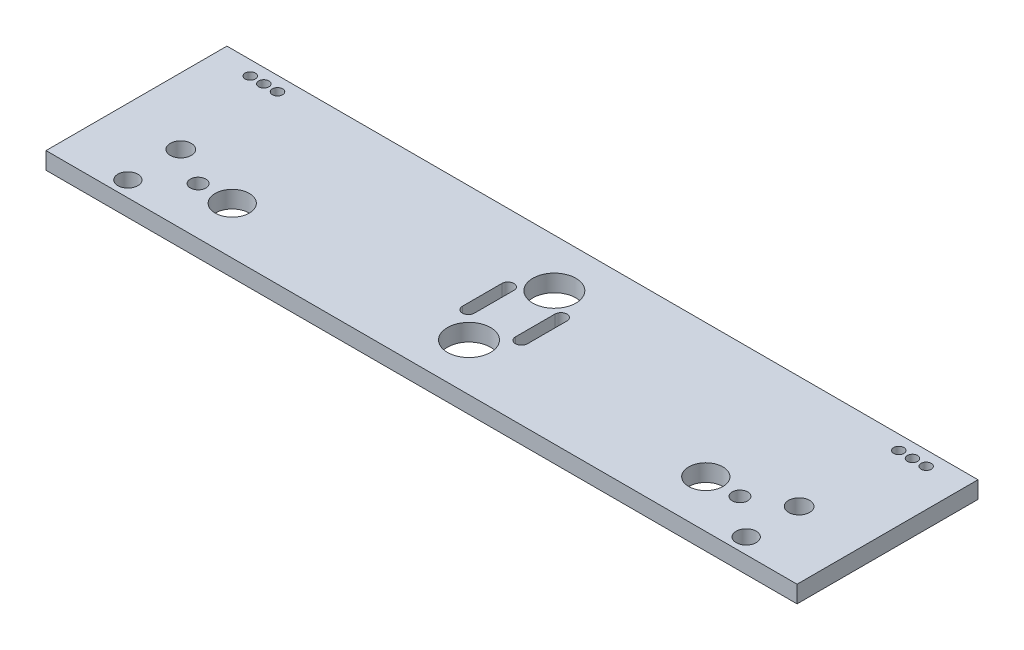
ISO-10303-21;
HEADER;
FILE_DESCRIPTION(('STEP AP214'),'2;1');
FILE_NAME('part.step','',(''),(''),'','','');
FILE_SCHEMA(('AUTOMOTIVE_DESIGN { 1 0 10303 214 1 1 1 1 }'));
ENDSEC;
DATA;
#1=APPLICATION_CONTEXT('core data for automotive mechanical design processes');
#2=APPLICATION_PROTOCOL_DEFINITION('international standard','automotive_design',2000,#1);
#3=PRODUCT_CONTEXT('',#1,'mechanical');
#4=PRODUCT('Part','Part','',(#3));
#5=PRODUCT_RELATED_PRODUCT_CATEGORY('part','',(#4));
#6=PRODUCT_DEFINITION_FORMATION('','',#4);
#7=PRODUCT_DEFINITION_CONTEXT('part definition',#1,'design');
#8=PRODUCT_DEFINITION('design','',#6,#7);
#9=PRODUCT_DEFINITION_SHAPE('','',#8);
#10=(LENGTH_UNIT() NAMED_UNIT(*) SI_UNIT(.MILLI.,.METRE.));
#11=(NAMED_UNIT(*) PLANE_ANGLE_UNIT() SI_UNIT($,.RADIAN.));
#12=(NAMED_UNIT(*) SI_UNIT($,.STERADIAN.) SOLID_ANGLE_UNIT());
#13=UNCERTAINTY_MEASURE_WITH_UNIT(LENGTH_MEASURE(1.E-05),#10,'distance_accuracy_value','');
#14=(GEOMETRIC_REPRESENTATION_CONTEXT(3) GLOBAL_UNCERTAINTY_ASSIGNED_CONTEXT((#13)) GLOBAL_UNIT_ASSIGNED_CONTEXT((#10,
#11,#12)) REPRESENTATION_CONTEXT('',''));
#15=CARTESIAN_POINT('',(0.,0.,0.));
#16=DIRECTION('',(0.,0.,1.));
#17=DIRECTION('',(1.,0.,0.));
#18=AXIS2_PLACEMENT_3D('',#15,#16,#17);
#19=CARTESIAN_POINT('',(-48.8743724696357,5.,0.));
#20=DIRECTION('',(1.,0.,0.));
#21=DIRECTION('',(0.,0.,-1.));
#22=AXIS2_PLACEMENT_3D('',#19,#20,#21);
#23=PLANE('',#22);
#24=DIRECTION('',(0.,0.,1.));
#25=VECTOR('',#24,1.);
#26=CARTESIAN_POINT('',(-48.8743724696357,0.,0.));
#27=LINE('',#26,#25);
#28=CARTESIAN_POINT('',(-48.8743724696357,0.,-23.1611978488646));
#29=VERTEX_POINT('',#28);
#30=CARTESIAN_POINT('',(-48.8743724696357,0.,-11.5911978488646));
#31=VERTEX_POINT('',#30);
#32=EDGE_CURVE('E226',#29,#31,#27,.T.);
#33=ORIENTED_EDGE('',*,*,#32,.T.);
#34=DIRECTION('',(0.,-1.,0.));
#35=VECTOR('',#34,1.);
#36=CARTESIAN_POINT('',(-48.8743724696357,5.,-11.5911978488646));
#37=LINE('',#36,#35);
#38=CARTESIAN_POINT('',(-48.8743724696357,5.,-11.5911978488646));
#39=VERTEX_POINT('',#38);
#40=EDGE_CURVE('E11',#39,#31,#37,.T.);
#41=ORIENTED_EDGE('',*,*,#40,.F.);
#42=DIRECTION('',(0.,0.,1.));
#43=VECTOR('',#42,1.);
#44=CARTESIAN_POINT('',(-48.8743724696357,5.,0.));
#45=LINE('',#44,#43);
#46=CARTESIAN_POINT('',(-48.8743724696357,5.,-23.1611978488646));
#47=VERTEX_POINT('',#46);
#48=EDGE_CURVE('E137',#47,#39,#45,.T.);
#49=ORIENTED_EDGE('',*,*,#48,.F.);
#50=DIRECTION('',(0.,-1.,0.));
#51=VECTOR('',#50,1.);
#52=CARTESIAN_POINT('',(-48.8743724696357,5.,-23.1611978488646));
#53=LINE('',#52,#51);
#54=EDGE_CURVE('E240',#47,#29,#53,.T.);
#55=ORIENTED_EDGE('',*,*,#54,.T.);
#56=EDGE_LOOP('',(#33,#41,#49,#55));
#57=FACE_BOUND('',#56,.T.);
#58=ADVANCED_FACE('F35',(#57),#23,.F.);
#59=CARTESIAN_POINT('',(-50.6343724696357,5.,-11.5911978488646));
#60=DIRECTION('',(0.,-1.,0.));
#61=DIRECTION('',(0.,0.,-1.));
#62=AXIS2_PLACEMENT_3D('',#59,#60,#61);
#63=CYLINDRICAL_SURFACE('',#62,1.76);
#64=CARTESIAN_POINT('',(-50.6343724696357,0.,-11.5911978488646));
#65=DIRECTION('',(0.,1.,0.));
#66=DIRECTION('',(0.,0.,1.));
#67=AXIS2_PLACEMENT_3D('',#64,#65,#66);
#68=CIRCLE('',#67,1.76);
#69=CARTESIAN_POINT('',(-52.3943724696356,0.,-11.5911978488646));
#70=VERTEX_POINT('',#69);
#71=EDGE_CURVE('E143',#31,#70,#68,.F.);
#72=ORIENTED_EDGE('',*,*,#71,.T.);
#73=DIRECTION('',(0.,-1.,0.));
#74=VECTOR('',#73,1.);
#75=CARTESIAN_POINT('',(-52.3943724696356,5.,-11.5911978488646));
#76=LINE('',#75,#74);
#77=CARTESIAN_POINT('',(-52.3943724696356,5.,-11.5911978488646));
#78=VERTEX_POINT('',#77);
#79=EDGE_CURVE('E45',#78,#70,#76,.T.);
#80=ORIENTED_EDGE('',*,*,#79,.F.);
#81=CARTESIAN_POINT('',(-50.6343724696357,5.,-11.5911978488646));
#82=DIRECTION('',(0.,1.,0.));
#83=DIRECTION('',(0.,0.,1.));
#84=AXIS2_PLACEMENT_3D('',#81,#82,#83);
#85=CIRCLE('',#84,1.76);
#86=EDGE_CURVE('E130',#39,#78,#85,.F.);
#87=ORIENTED_EDGE('',*,*,#86,.F.);
#88=ORIENTED_EDGE('',*,*,#40,.T.);
#89=EDGE_LOOP('',(#72,#80,#87,#88));
#90=FACE_BOUND('',#89,.T.);
#91=ADVANCED_FACE('F142',(#90),#63,.F.);
#92=CARTESIAN_POINT('',(-52.3943724696356,5.,0.));
#93=DIRECTION('',(1.,0.,0.));
#94=DIRECTION('',(0.,0.,-1.));
#95=AXIS2_PLACEMENT_3D('',#92,#93,#94);
#96=PLANE('',#95);
#97=DIRECTION('',(0.,0.,1.));
#98=VECTOR('',#97,1.);
#99=CARTESIAN_POINT('',(-52.3943724696356,0.,0.));
#100=LINE('',#99,#98);
#101=CARTESIAN_POINT('',(-52.3943724696356,0.,-23.1611978488646));
#102=VERTEX_POINT('',#101);
#103=EDGE_CURVE('E230',#102,#70,#100,.T.);
#104=ORIENTED_EDGE('',*,*,#103,.F.);
#105=DIRECTION('',(0.,-1.,0.));
#106=VECTOR('',#105,1.);
#107=CARTESIAN_POINT('',(-52.3943724696356,5.,-23.1611978488646));
#108=LINE('',#107,#106);
#109=CARTESIAN_POINT('',(-52.3943724696356,5.,-23.1611978488646));
#110=VERTEX_POINT('',#109);
#111=EDGE_CURVE('E94',#110,#102,#108,.T.);
#112=ORIENTED_EDGE('',*,*,#111,.F.);
#113=DIRECTION('',(0.,0.,1.));
#114=VECTOR('',#113,1.);
#115=CARTESIAN_POINT('',(-52.3943724696356,5.,0.));
#116=LINE('',#115,#114);
#117=EDGE_CURVE('E135',#110,#78,#116,.T.);
#118=ORIENTED_EDGE('',*,*,#117,.T.);
#119=ORIENTED_EDGE('',*,*,#79,.T.);
#120=EDGE_LOOP('',(#104,#112,#118,#119));
#121=FACE_BOUND('',#120,.T.);
#122=ADVANCED_FACE('F148',(#121),#96,.T.);
#123=CARTESIAN_POINT('',(67.1356275303644,5.,0.));
#124=DIRECTION('',(1.,0.,0.));
#125=DIRECTION('',(0.,0.,-1.));
#126=AXIS2_PLACEMENT_3D('',#123,#124,#125);
#127=PLANE('',#126);
#128=DIRECTION('',(0.,0.,1.));
#129=VECTOR('',#128,1.);
#130=CARTESIAN_POINT('',(67.1356275303644,0.,0.));
#131=LINE('',#130,#129);
#132=CARTESIAN_POINT('',(67.1356275303644,0.,-43.0870445344129));
#133=VERTEX_POINT('',#132);
#134=CARTESIAN_POINT('',(67.1356275303644,0.,9.91295546558705));
#135=VERTEX_POINT('',#134);
#136=EDGE_CURVE('E214',#133,#135,#131,.T.);
#137=ORIENTED_EDGE('',*,*,#136,.F.);
#138=DIRECTION('',(0.,-1.,0.));
#139=VECTOR('',#138,1.);
#140=CARTESIAN_POINT('',(67.1356275303644,5.,-43.0870445344129));
#141=LINE('',#140,#139);
#142=CARTESIAN_POINT('',(67.1356275303644,5.,-43.0870445344129));
#143=VERTEX_POINT('',#142);
#144=EDGE_CURVE('E242',#143,#133,#141,.T.);
#145=ORIENTED_EDGE('',*,*,#144,.F.);
#146=DIRECTION('',(0.,0.,1.));
#147=VECTOR('',#146,1.);
#148=CARTESIAN_POINT('',(67.1356275303644,5.,0.));
#149=LINE('',#148,#147);
#150=CARTESIAN_POINT('',(67.1356275303644,5.,9.91295546558705));
#151=VERTEX_POINT('',#150);
#152=EDGE_CURVE('E307',#143,#151,#149,.T.);
#153=ORIENTED_EDGE('',*,*,#152,.T.);
#154=DIRECTION('',(0.,-1.,0.));
#155=VECTOR('',#154,1.);
#156=CARTESIAN_POINT('',(67.1356275303644,5.,9.91295546558705));
#157=LINE('',#156,#155);
#158=EDGE_CURVE('E244',#151,#135,#157,.T.);
#159=ORIENTED_EDGE('',*,*,#158,.T.);
#160=EDGE_LOOP('',(#137,#145,#153,#159));
#161=FACE_BOUND('',#160,.T.);
#162=ADVANCED_FACE('F327',(#161),#127,.T.);
#163=CARTESIAN_POINT('',(0.,5.,-43.0870445344129));
#164=DIRECTION('',(0.,0.,-1.));
#165=DIRECTION('',(-1.,0.,0.));
#166=AXIS2_PLACEMENT_3D('',#163,#164,#165);
#167=PLANE('',#166);
#168=DIRECTION('',(1.,0.,0.));
#169=VECTOR('',#168,1.);
#170=CARTESIAN_POINT('',(0.,0.,-43.0870445344129));
#171=LINE('',#170,#169);
#172=CARTESIAN_POINT('',(-152.864372469636,0.,-43.0870445344129));
#173=VERTEX_POINT('',#172);
#174=EDGE_CURVE('E217',#173,#133,#171,.T.);
#175=ORIENTED_EDGE('',*,*,#174,.F.);
#176=DIRECTION('',(0.,-1.,0.));
#177=VECTOR('',#176,1.);
#178=CARTESIAN_POINT('',(-152.864372469636,5.,-43.0870445344129));
#179=LINE('',#178,#177);
#180=CARTESIAN_POINT('',(-152.864372469636,5.,-43.0870445344129));
#181=VERTEX_POINT('',#180);
#182=EDGE_CURVE('E249',#181,#173,#179,.T.);
#183=ORIENTED_EDGE('',*,*,#182,.F.);
#184=DIRECTION('',(1.,0.,0.));
#185=VECTOR('',#184,1.);
#186=CARTESIAN_POINT('',(0.,5.,-43.0870445344129));
#187=LINE('',#186,#185);
#188=EDGE_CURVE('E310',#181,#143,#187,.T.);
#189=ORIENTED_EDGE('',*,*,#188,.T.);
#190=ORIENTED_EDGE('',*,*,#144,.T.);
#191=EDGE_LOOP('',(#175,#183,#189,#190));
#192=FACE_BOUND('',#191,.T.);
#193=ADVANCED_FACE('F330',(#192),#167,.T.);
#194=CARTESIAN_POINT('',(-152.864372469636,5.,0.));
#195=DIRECTION('',(1.,0.,0.));
#196=DIRECTION('',(0.,0.,-1.));
#197=AXIS2_PLACEMENT_3D('',#194,#195,#196);
#198=PLANE('',#197);
#199=DIRECTION('',(0.,0.,1.));
#200=VECTOR('',#199,1.);
#201=CARTESIAN_POINT('',(-152.864372469636,0.,0.));
#202=LINE('',#201,#200);
#203=CARTESIAN_POINT('',(-152.864372469636,0.,9.91295546558705));
#204=VERTEX_POINT('',#203);
#205=EDGE_CURVE('E220',#173,#204,#202,.T.);
#206=ORIENTED_EDGE('',*,*,#205,.T.);
#207=DIRECTION('',(0.,-1.,0.));
#208=VECTOR('',#207,1.);
#209=CARTESIAN_POINT('',(-152.864372469636,5.,9.91295546558705));
#210=LINE('',#209,#208);
#211=CARTESIAN_POINT('',(-152.864372469636,5.,9.91295546558705));
#212=VERTEX_POINT('',#211);
#213=EDGE_CURVE('E246',#212,#204,#210,.T.);
#214=ORIENTED_EDGE('',*,*,#213,.F.);
#215=DIRECTION('',(0.,0.,1.));
#216=VECTOR('',#215,1.);
#217=CARTESIAN_POINT('',(-152.864372469636,5.,0.));
#218=LINE('',#217,#216);
#219=EDGE_CURVE('E313',#181,#212,#218,.T.);
#220=ORIENTED_EDGE('',*,*,#219,.F.);
#221=ORIENTED_EDGE('',*,*,#182,.T.);
#222=EDGE_LOOP('',(#206,#214,#220,#221));
#223=FACE_BOUND('',#222,.T.);
#224=ADVANCED_FACE('F333',(#223),#198,.F.);
#225=CARTESIAN_POINT('',(-35.0943724696356,5.,-23.1611978488646));
#226=DIRECTION('',(0.,-1.,0.));
#227=DIRECTION('',(0.,0.,-1.));
#228=AXIS2_PLACEMENT_3D('',#225,#226,#227);
#229=CYLINDRICAL_SURFACE('',#228,1.76000000000001);
#230=CARTESIAN_POINT('',(-35.0943724696356,0.,-23.1611978488646));
#231=DIRECTION('',(0.,1.,0.));
#232=DIRECTION('',(0.,0.,1.));
#233=AXIS2_PLACEMENT_3D('',#230,#231,#232);
#234=CIRCLE('',#233,1.76000000000001);
#235=CARTESIAN_POINT('',(-33.3343724696356,0.,-23.1611978488646));
#236=VERTEX_POINT('',#235);
#237=CARTESIAN_POINT('',(-36.8543724696356,0.,-23.1611978488646));
#238=VERTEX_POINT('',#237);
#239=EDGE_CURVE('E178',#236,#238,#234,.T.);
#240=ORIENTED_EDGE('',*,*,#239,.F.);
#241=DIRECTION('',(0.,-1.,0.));
#242=VECTOR('',#241,1.);
#243=CARTESIAN_POINT('',(-33.3343724696356,5.,-23.1611978488646));
#244=LINE('',#243,#242);
#245=CARTESIAN_POINT('',(-33.3343724696356,5.,-23.1611978488646));
#246=VERTEX_POINT('',#245);
#247=EDGE_CURVE('E39',#246,#236,#244,.T.);
#248=ORIENTED_EDGE('',*,*,#247,.F.);
#249=CARTESIAN_POINT('',(-35.0943724696356,5.,-23.1611978488646));
#250=DIRECTION('',(0.,1.,0.));
#251=DIRECTION('',(0.,0.,1.));
#252=AXIS2_PLACEMENT_3D('',#249,#250,#251);
#253=CIRCLE('',#252,1.76000000000001);
#254=CARTESIAN_POINT('',(-36.8543724696356,5.,-23.1611978488646));
#255=VERTEX_POINT('',#254);
#256=EDGE_CURVE('E472',#246,#255,#253,.T.);
#257=ORIENTED_EDGE('',*,*,#256,.T.);
#258=DIRECTION('',(0.,-1.,0.));
#259=VECTOR('',#258,1.);
#260=CARTESIAN_POINT('',(-36.8543724696356,5.,-23.1611978488646));
#261=LINE('',#260,#259);
#262=EDGE_CURVE('E159',#255,#238,#261,.T.);
#263=ORIENTED_EDGE('',*,*,#262,.T.);
#264=EDGE_LOOP('',(#240,#248,#257,#263));
#265=FACE_BOUND('',#264,.T.);
#266=ADVANCED_FACE('F264',(#265),#229,.F.);
#267=CARTESIAN_POINT('',(-33.3343724696356,5.,0.));
#268=DIRECTION('',(-1.,0.,0.));
#269=DIRECTION('',(0.,0.,1.));
#270=AXIS2_PLACEMENT_3D('',#267,#268,#269);
#271=PLANE('',#270);
#272=DIRECTION('',(0.,0.,-1.));
#273=VECTOR('',#272,1.);
#274=CARTESIAN_POINT('',(-33.3343724696356,0.,0.));
#275=LINE('',#274,#273);
#276=CARTESIAN_POINT('',(-33.3343724696356,0.,-11.5911978488646));
#277=VERTEX_POINT('',#276);
#278=EDGE_CURVE('E181',#277,#236,#275,.T.);
#279=ORIENTED_EDGE('',*,*,#278,.F.);
#280=DIRECTION('',(0.,-1.,0.));
#281=VECTOR('',#280,1.);
#282=CARTESIAN_POINT('',(-33.3343724696356,5.,-11.5911978488646));
#283=LINE('',#282,#281);
#284=CARTESIAN_POINT('',(-33.3343724696356,5.,-11.5911978488646));
#285=VERTEX_POINT('',#284);
#286=EDGE_CURVE('E254',#285,#277,#283,.T.);
#287=ORIENTED_EDGE('',*,*,#286,.F.);
#288=DIRECTION('',(0.,0.,-1.));
#289=VECTOR('',#288,1.);
#290=CARTESIAN_POINT('',(-33.3343724696356,5.,0.));
#291=LINE('',#290,#289);
#292=EDGE_CURVE('E263',#285,#246,#291,.T.);
#293=ORIENTED_EDGE('',*,*,#292,.T.);
#294=ORIENTED_EDGE('',*,*,#247,.T.);
#295=EDGE_LOOP('',(#279,#287,#293,#294));
#296=FACE_BOUND('',#295,.T.);
#297=ADVANCED_FACE('F261',(#296),#271,.T.);
#298=CARTESIAN_POINT('',(-35.0943724696357,5.,-11.5911978488646));
#299=DIRECTION('',(0.,-1.,0.));
#300=DIRECTION('',(0.,0.,-1.));
#301=AXIS2_PLACEMENT_3D('',#298,#299,#300);
#302=CYLINDRICAL_SURFACE('',#301,1.76000000000001);
#303=CARTESIAN_POINT('',(-35.0943724696357,0.,-11.5911978488646));
#304=DIRECTION('',(0.,1.,0.));
#305=DIRECTION('',(0.,0.,1.));
#306=AXIS2_PLACEMENT_3D('',#303,#304,#305);
#307=CIRCLE('',#306,1.76000000000001);
#308=CARTESIAN_POINT('',(-36.8543724696357,0.,-11.5911978488646));
#309=VERTEX_POINT('',#308);
#310=EDGE_CURVE('E184',#309,#277,#307,.T.);
#311=ORIENTED_EDGE('',*,*,#310,.F.);
#312=DIRECTION('',(0.,-1.,0.));
#313=VECTOR('',#312,1.);
#314=CARTESIAN_POINT('',(-36.8543724696357,5.,-11.5911978488646));
#315=LINE('',#314,#313);
#316=CARTESIAN_POINT('',(-36.8543724696357,5.,-11.5911978488646));
#317=VERTEX_POINT('',#316);
#318=EDGE_CURVE('E253',#317,#309,#315,.T.);
#319=ORIENTED_EDGE('',*,*,#318,.F.);
#320=CARTESIAN_POINT('',(-35.0943724696357,5.,-11.5911978488646));
#321=DIRECTION('',(0.,1.,0.));
#322=DIRECTION('',(0.,0.,1.));
#323=AXIS2_PLACEMENT_3D('',#320,#321,#322);
#324=CIRCLE('',#323,1.76000000000001);
#325=EDGE_CURVE('E271',#317,#285,#324,.T.);
#326=ORIENTED_EDGE('',*,*,#325,.T.);
#327=ORIENTED_EDGE('',*,*,#286,.T.);
#328=EDGE_LOOP('',(#311,#319,#326,#327));
#329=FACE_BOUND('',#328,.T.);
#330=ADVANCED_FACE('F269',(#329),#302,.F.);
#331=CARTESIAN_POINT('',(-133.426055638965,5.,-10.1273106860022));
#332=DIRECTION('',(0.,-1.,0.));
#333=DIRECTION('',(0.,0.,-1.));
#334=AXIS2_PLACEMENT_3D('',#331,#332,#333);
#335=CYLINDRICAL_SURFACE('',#334,3.07842905175671);
#336=CARTESIAN_POINT('',(-133.426055638965,5.,-10.1273106860022));
#337=DIRECTION('',(0.,1.,0.));
#338=DIRECTION('',(0.,0.,1.));
#339=AXIS2_PLACEMENT_3D('',#336,#337,#338);
#340=CIRCLE('',#339,3.07842905175671);
#341=CARTESIAN_POINT('',(-133.426055638965,5.,-7.04888163424551));
#342=VERTEX_POINT('',#341);
#343=EDGE_CURVE('E150',#342,#342,#340,.F.);
#344=ORIENTED_EDGE('',*,*,#343,.F.);
#345=EDGE_LOOP('',(#344));
#346=FACE_BOUND('',#345,.T.);
#347=CARTESIAN_POINT('',(-133.426055638965,0.,-10.1273106860022));
#348=DIRECTION('',(0.,1.,0.));
#349=DIRECTION('',(0.,0.,1.));
#350=AXIS2_PLACEMENT_3D('',#347,#348,#349);
#351=CIRCLE('',#350,3.07842905175671);
#352=CARTESIAN_POINT('',(-133.426055638965,0.,-7.04888163424551));
#353=VERTEX_POINT('',#352);
#354=EDGE_CURVE('E233',#353,#353,#351,.F.);
#355=ORIENTED_EDGE('',*,*,#354,.T.);
#356=EDGE_LOOP('',(#355));
#357=FACE_BOUND('',#356,.T.);
#358=ADVANCED_FACE('F414',(#346,#357),#335,.F.);
#359=CARTESIAN_POINT('',(-50.6343724696356,5.,-23.1611978488646));
#360=DIRECTION('',(0.,-1.,0.));
#361=DIRECTION('',(0.,0.,-1.));
#362=AXIS2_PLACEMENT_3D('',#359,#360,#361);
#363=CYLINDRICAL_SURFACE('',#362,1.76);
#364=CARTESIAN_POINT('',(-50.6343724696356,0.,-23.1611978488646));
#365=DIRECTION('',(0.,1.,0.));
#366=DIRECTION('',(0.,0.,1.));
#367=AXIS2_PLACEMENT_3D('',#364,#365,#366);
#368=CIRCLE('',#367,1.76);
#369=EDGE_CURVE('E97',#102,#29,#368,.F.);
#370=ORIENTED_EDGE('',*,*,#369,.T.);
#371=ORIENTED_EDGE('',*,*,#54,.F.);
#372=CARTESIAN_POINT('',(-50.6343724696356,5.,-23.1611978488646));
#373=DIRECTION('',(0.,1.,0.));
#374=DIRECTION('',(0.,0.,1.));
#375=AXIS2_PLACEMENT_3D('',#372,#373,#374);
#376=CIRCLE('',#375,1.76);
#377=EDGE_CURVE('E54',#110,#47,#376,.F.);
#378=ORIENTED_EDGE('',*,*,#377,.F.);
#379=ORIENTED_EDGE('',*,*,#111,.T.);
#380=EDGE_LOOP('',(#370,#371,#378,#379));
#381=FACE_BOUND('',#380,.T.);
#382=ADVANCED_FACE('F371',(#381),#363,.F.);
#383=CARTESIAN_POINT('',(0.,5.,9.91295546558705));
#384=DIRECTION('',(0.,0.,-1.));
#385=DIRECTION('',(-1.,0.,0.));
#386=AXIS2_PLACEMENT_3D('',#383,#384,#385);
#387=PLANE('',#386);
#388=DIRECTION('',(1.,0.,0.));
#389=VECTOR('',#388,1.);
#390=CARTESIAN_POINT('',(0.,0.,9.91295546558705));
#391=LINE('',#390,#389);
#392=EDGE_CURVE('E223',#204,#135,#391,.T.);
#393=ORIENTED_EDGE('',*,*,#392,.T.);
#394=ORIENTED_EDGE('',*,*,#158,.F.);
#395=DIRECTION('',(1.,0.,0.));
#396=VECTOR('',#395,1.);
#397=CARTESIAN_POINT('',(0.,5.,9.91295546558705));
#398=LINE('',#397,#396);
#399=EDGE_CURVE('E316',#212,#151,#398,.T.);
#400=ORIENTED_EDGE('',*,*,#399,.F.);
#401=ORIENTED_EDGE('',*,*,#213,.T.);
#402=EDGE_LOOP('',(#393,#394,#400,#401));
#403=FACE_BOUND('',#402,.T.);
#404=ADVANCED_FACE('F324',(#403),#387,.F.);
#405=CARTESIAN_POINT('',(56.1356275303644,5.,-38.9070445344129));
#406=DIRECTION('',(0.,-1.,0.));
#407=DIRECTION('',(0.,0.,-1.));
#408=AXIS2_PLACEMENT_3D('',#405,#406,#407);
#409=CYLINDRICAL_SURFACE('',#408,1.50500000000001);
#410=CARTESIAN_POINT('',(56.1356275303644,5.,-38.9070445344129));
#411=DIRECTION('',(0.,1.,0.));
#412=DIRECTION('',(0.,0.,1.));
#413=AXIS2_PLACEMENT_3D('',#410,#411,#412);
#414=CIRCLE('',#413,1.50500000000001);
#415=CARTESIAN_POINT('',(56.1356275303644,5.,-37.4020445344129));
#416=VERTEX_POINT('',#415);
#417=EDGE_CURVE('E304',#416,#416,#414,.T.);
#418=ORIENTED_EDGE('',*,*,#417,.T.);
#419=EDGE_LOOP('',(#418));
#420=FACE_BOUND('',#419,.T.);
#421=CARTESIAN_POINT('',(56.1356275303644,0.,-38.9070445344129));
#422=DIRECTION('',(0.,1.,0.));
#423=DIRECTION('',(0.,0.,1.));
#424=AXIS2_PLACEMENT_3D('',#421,#422,#423);
#425=CIRCLE('',#424,1.50500000000001);
#426=CARTESIAN_POINT('',(56.1356275303644,0.,-37.4020445344129));
#427=VERTEX_POINT('',#426);
#428=EDGE_CURVE('E211',#427,#427,#425,.T.);
#429=ORIENTED_EDGE('',*,*,#428,.F.);
#430=EDGE_LOOP('',(#429));
#431=FACE_BOUND('',#430,.T.);
#432=ADVANCED_FACE('F370',(#420,#431),#409,.F.);
#433=CARTESIAN_POINT('',(52.1256275303644,5.,-38.9070445344129));
#434=DIRECTION('',(0.,-1.,0.));
#435=DIRECTION('',(0.,0.,-1.));
#436=AXIS2_PLACEMENT_3D('',#433,#434,#435);
#437=CYLINDRICAL_SURFACE('',#436,1.50500000000001);
#438=CARTESIAN_POINT('',(52.1256275303644,5.,-38.9070445344129));
#439=DIRECTION('',(0.,1.,0.));
#440=DIRECTION('',(0.,0.,1.));
#441=AXIS2_PLACEMENT_3D('',#438,#439,#440);
#442=CIRCLE('',#441,1.50500000000001);
#443=CARTESIAN_POINT('',(52.1256275303644,5.,-37.4020445344129));
#444=VERTEX_POINT('',#443);
#445=EDGE_CURVE('E301',#444,#444,#442,.T.);
#446=ORIENTED_EDGE('',*,*,#445,.T.);
#447=EDGE_LOOP('',(#446));
#448=FACE_BOUND('',#447,.T.);
#449=CARTESIAN_POINT('',(52.1256275303644,0.,-38.9070445344129));
#450=DIRECTION('',(0.,1.,0.));
#451=DIRECTION('',(0.,0.,1.));
#452=AXIS2_PLACEMENT_3D('',#449,#450,#451);
#453=CIRCLE('',#452,1.50500000000001);
#454=CARTESIAN_POINT('',(52.1256275303644,0.,-37.4020445344129));
#455=VERTEX_POINT('',#454);
#456=EDGE_CURVE('E208',#455,#455,#453,.T.);
#457=ORIENTED_EDGE('',*,*,#456,.F.);
#458=EDGE_LOOP('',(#457));
#459=FACE_BOUND('',#458,.T.);
#460=ADVANCED_FACE('F380',(#448,#459),#437,.F.);
#461=CARTESIAN_POINT('',(48.1156275303644,5.,-38.9070445344129));
#462=DIRECTION('',(0.,-1.,0.));
#463=DIRECTION('',(0.,0.,-1.));
#464=AXIS2_PLACEMENT_3D('',#461,#462,#463);
#465=CYLINDRICAL_SURFACE('',#464,1.50500000000001);
#466=CARTESIAN_POINT('',(48.1156275303644,5.,-38.9070445344129));
#467=DIRECTION('',(0.,1.,0.));
#468=DIRECTION('',(0.,0.,1.));
#469=AXIS2_PLACEMENT_3D('',#466,#467,#468);
#470=CIRCLE('',#469,1.50500000000001);
#471=CARTESIAN_POINT('',(48.1156275303644,5.,-37.4020445344129));
#472=VERTEX_POINT('',#471);
#473=EDGE_CURVE('E298',#472,#472,#470,.T.);
#474=ORIENTED_EDGE('',*,*,#473,.T.);
#475=EDGE_LOOP('',(#474));
#476=FACE_BOUND('',#475,.T.);
#477=CARTESIAN_POINT('',(48.1156275303644,0.,-38.9070445344129));
#478=DIRECTION('',(0.,1.,0.));
#479=DIRECTION('',(0.,0.,1.));
#480=AXIS2_PLACEMENT_3D('',#477,#478,#479);
#481=CIRCLE('',#480,1.50500000000001);
#482=CARTESIAN_POINT('',(48.1156275303644,0.,-37.4020445344129));
#483=VERTEX_POINT('',#482);
#484=EDGE_CURVE('E205',#483,#483,#481,.T.);
#485=ORIENTED_EDGE('',*,*,#484,.F.);
#486=EDGE_LOOP('',(#485));
#487=FACE_BOUND('',#486,.T.);
#488=ADVANCED_FACE('F384',(#476,#487),#465,.F.);
#489=CARTESIAN_POINT('',(-141.874372469636,5.,-38.907044534413));
#490=DIRECTION('',(0.,-1.,0.));
#491=DIRECTION('',(0.,0.,-1.));
#492=AXIS2_PLACEMENT_3D('',#489,#490,#491);
#493=CYLINDRICAL_SURFACE('',#492,1.50500000000002);
#494=CARTESIAN_POINT('',(-141.874372469636,5.,-38.907044534413));
#495=DIRECTION('',(0.,1.,0.));
#496=DIRECTION('',(0.,0.,1.));
#497=AXIS2_PLACEMENT_3D('',#494,#495,#496);
#498=CIRCLE('',#497,1.50500000000002);
#499=CARTESIAN_POINT('',(-141.874372469636,5.,-37.402044534413));
#500=VERTEX_POINT('',#499);
#501=EDGE_CURVE('E295',#500,#500,#498,.T.);
#502=ORIENTED_EDGE('',*,*,#501,.T.);
#503=EDGE_LOOP('',(#502));
#504=FACE_BOUND('',#503,.T.);
#505=CARTESIAN_POINT('',(-141.874372469636,0.,-38.907044534413));
#506=DIRECTION('',(0.,1.,0.));
#507=DIRECTION('',(0.,0.,1.));
#508=AXIS2_PLACEMENT_3D('',#505,#506,#507);
#509=CIRCLE('',#508,1.50500000000002);
#510=CARTESIAN_POINT('',(-141.874372469636,0.,-37.402044534413));
#511=VERTEX_POINT('',#510);
#512=EDGE_CURVE('E202',#511,#511,#509,.T.);
#513=ORIENTED_EDGE('',*,*,#512,.F.);
#514=EDGE_LOOP('',(#513));
#515=FACE_BOUND('',#514,.T.);
#516=ADVANCED_FACE('F388',(#504,#515),#493,.F.);
#517=CARTESIAN_POINT('',(-137.874372469636,5.,-38.907044534413));
#518=DIRECTION('',(0.,-1.,0.));
#519=DIRECTION('',(0.,0.,-1.));
#520=AXIS2_PLACEMENT_3D('',#517,#518,#519);
#521=CYLINDRICAL_SURFACE('',#520,1.50500000000004);
#522=CARTESIAN_POINT('',(-137.874372469636,5.,-38.907044534413));
#523=DIRECTION('',(0.,1.,0.));
#524=DIRECTION('',(0.,0.,1.));
#525=AXIS2_PLACEMENT_3D('',#522,#523,#524);
#526=CIRCLE('',#525,1.50500000000004);
#527=CARTESIAN_POINT('',(-137.874372469636,5.,-37.4020445344129));
#528=VERTEX_POINT('',#527);
#529=EDGE_CURVE('E292',#528,#528,#526,.T.);
#530=ORIENTED_EDGE('',*,*,#529,.T.);
#531=EDGE_LOOP('',(#530));
#532=FACE_BOUND('',#531,.T.);
#533=CARTESIAN_POINT('',(-137.874372469636,0.,-38.907044534413));
#534=DIRECTION('',(0.,1.,0.));
#535=DIRECTION('',(0.,0.,1.));
#536=AXIS2_PLACEMENT_3D('',#533,#534,#535);
#537=CIRCLE('',#536,1.50500000000004);
#538=CARTESIAN_POINT('',(-137.874372469636,0.,-37.4020445344129));
#539=VERTEX_POINT('',#538);
#540=EDGE_CURVE('E199',#539,#539,#537,.T.);
#541=ORIENTED_EDGE('',*,*,#540,.F.);
#542=EDGE_LOOP('',(#541));
#543=FACE_BOUND('',#542,.T.);
#544=ADVANCED_FACE('F392',(#532,#543),#521,.F.);
#545=CARTESIAN_POINT('',(-133.874372469636,5.,-38.907044534413));
#546=DIRECTION('',(0.,-1.,0.));
#547=DIRECTION('',(0.,0.,-1.));
#548=AXIS2_PLACEMENT_3D('',#545,#546,#547);
#549=CYLINDRICAL_SURFACE('',#548,1.50500000000002);
#550=CARTESIAN_POINT('',(-133.874372469636,5.,-38.907044534413));
#551=DIRECTION('',(0.,1.,0.));
#552=DIRECTION('',(0.,0.,1.));
#553=AXIS2_PLACEMENT_3D('',#550,#551,#552);
#554=CIRCLE('',#553,1.50500000000002);
#555=CARTESIAN_POINT('',(-133.874372469636,5.,-37.402044534413));
#556=VERTEX_POINT('',#555);
#557=EDGE_CURVE('E289',#556,#556,#554,.T.);
#558=ORIENTED_EDGE('',*,*,#557,.T.);
#559=EDGE_LOOP('',(#558));
#560=FACE_BOUND('',#559,.T.);
#561=CARTESIAN_POINT('',(-133.874372469636,0.,-38.907044534413));
#562=DIRECTION('',(0.,1.,0.));
#563=DIRECTION('',(0.,0.,1.));
#564=AXIS2_PLACEMENT_3D('',#561,#562,#563);
#565=CIRCLE('',#564,1.50500000000002);
#566=CARTESIAN_POINT('',(-133.874372469636,0.,-37.402044534413));
#567=VERTEX_POINT('',#566);
#568=EDGE_CURVE('E196',#567,#567,#565,.T.);
#569=ORIENTED_EDGE('',*,*,#568,.F.);
#570=EDGE_LOOP('',(#569));
#571=FACE_BOUND('',#570,.T.);
#572=ADVANCED_FACE('F396',(#560,#571),#549,.F.);
#573=CARTESIAN_POINT('',(-42.8643724696356,5.,-28.9979936359451));
#574=DIRECTION('',(0.,-1.,0.));
#575=DIRECTION('',(0.,0.,-1.));
#576=AXIS2_PLACEMENT_3D('',#573,#574,#575);
#577=CYLINDRICAL_SURFACE('',#576,6.315);
#578=CARTESIAN_POINT('',(-42.8643724696356,5.,-28.9979936359451));
#579=DIRECTION('',(0.,1.,0.));
#580=DIRECTION('',(0.,0.,1.));
#581=AXIS2_PLACEMENT_3D('',#578,#579,#580);
#582=CIRCLE('',#581,6.315);
#583=CARTESIAN_POINT('',(-42.8643724696356,5.,-22.6829936359451));
#584=VERTEX_POINT('',#583);
#585=EDGE_CURVE('E283',#584,#584,#582,.T.);
#586=ORIENTED_EDGE('',*,*,#585,.T.);
#587=EDGE_LOOP('',(#586));
#588=FACE_BOUND('',#587,.T.);
#589=CARTESIAN_POINT('',(-42.8643724696356,0.,-28.9979936359451));
#590=DIRECTION('',(0.,1.,0.));
#591=DIRECTION('',(0.,0.,1.));
#592=AXIS2_PLACEMENT_3D('',#589,#590,#591);
#593=CIRCLE('',#592,6.315);
#594=CARTESIAN_POINT('',(-42.8643724696356,0.,-22.6829936359451));
#595=VERTEX_POINT('',#594);
#596=EDGE_CURVE('E193',#595,#595,#593,.T.);
#597=ORIENTED_EDGE('',*,*,#596,.F.);
#598=EDGE_LOOP('',(#597));
#599=FACE_BOUND('',#598,.T.);
#600=ADVANCED_FACE('F400',(#588,#599),#577,.F.);
#601=CARTESIAN_POINT('',(-42.8643724696356,5.,-3.99799363594508));
#602=DIRECTION('',(0.,-1.,0.));
#603=DIRECTION('',(0.,0.,-1.));
#604=AXIS2_PLACEMENT_3D('',#601,#602,#603);
#605=CYLINDRICAL_SURFACE('',#604,6.31499999999999);
#606=CARTESIAN_POINT('',(-42.8643724696356,5.,-3.99799363594508));
#607=DIRECTION('',(0.,1.,0.));
#608=DIRECTION('',(0.,0.,1.));
#609=AXIS2_PLACEMENT_3D('',#606,#607,#608);
#610=CIRCLE('',#609,6.31499999999999);
#611=CARTESIAN_POINT('',(-42.8643724696356,5.,2.31700636405491));
#612=VERTEX_POINT('',#611);
#613=EDGE_CURVE('E280',#612,#612,#610,.T.);
#614=ORIENTED_EDGE('',*,*,#613,.T.);
#615=EDGE_LOOP('',(#614));
#616=FACE_BOUND('',#615,.T.);
#617=CARTESIAN_POINT('',(-42.8643724696356,0.,-3.99799363594508));
#618=DIRECTION('',(0.,1.,0.));
#619=DIRECTION('',(0.,0.,1.));
#620=AXIS2_PLACEMENT_3D('',#617,#618,#619);
#621=CIRCLE('',#620,6.31499999999999);
#622=CARTESIAN_POINT('',(-42.8643724696356,0.,2.31700636405491));
#623=VERTEX_POINT('',#622);
#624=EDGE_CURVE('E190',#623,#623,#621,.T.);
#625=ORIENTED_EDGE('',*,*,#624,.F.);
#626=EDGE_LOOP('',(#625));
#627=FACE_BOUND('',#626,.T.);
#628=ADVANCED_FACE('F404',(#616,#627),#605,.F.);
#629=CARTESIAN_POINT('',(-36.8543724696357,5.,0.));
#630=DIRECTION('',(1.,0.,0.));
#631=DIRECTION('',(0.,0.,-1.));
#632=AXIS2_PLACEMENT_3D('',#629,#630,#631);
#633=PLANE('',#632);
#634=DIRECTION('',(0.,0.,1.));
#635=VECTOR('',#634,1.);
#636=CARTESIAN_POINT('',(-36.8543724696357,0.,0.));
#637=LINE('',#636,#635);
#638=EDGE_CURVE('E187',#238,#309,#637,.T.);
#639=ORIENTED_EDGE('',*,*,#638,.F.);
#640=ORIENTED_EDGE('',*,*,#262,.F.);
#641=DIRECTION('',(0.,0.,1.));
#642=VECTOR('',#641,1.);
#643=CARTESIAN_POINT('',(-36.8543724696357,5.,0.));
#644=LINE('',#643,#642);
#645=EDGE_CURVE('E277',#255,#317,#644,.T.);
#646=ORIENTED_EDGE('',*,*,#645,.T.);
#647=ORIENTED_EDGE('',*,*,#318,.T.);
#648=EDGE_LOOP('',(#639,#640,#646,#647));
#649=FACE_BOUND('',#648,.T.);
#650=ADVANCED_FACE('F279',(#649),#633,.T.);
#651=CARTESIAN_POINT('',(47.6973106996936,5.,-10.1273106860022));
#652=DIRECTION('',(0.,-1.,0.));
#653=DIRECTION('',(0.,0.,-1.));
#654=AXIS2_PLACEMENT_3D('',#651,#652,#653);
#655=CYLINDRICAL_SURFACE('',#654,3.07842905175671);
#656=CARTESIAN_POINT('',(47.6973106996936,5.,-10.1273106860022));
#657=DIRECTION('',(0.,1.,0.));
#658=DIRECTION('',(0.,0.,1.));
#659=AXIS2_PLACEMENT_3D('',#656,#657,#658);
#660=CIRCLE('',#659,3.07842905175671);
#661=CARTESIAN_POINT('',(47.6973106996936,5.,-7.0488816342455));
#662=VERTEX_POINT('',#661);
#663=EDGE_CURVE('E469',#662,#662,#660,.T.);
#664=ORIENTED_EDGE('',*,*,#663,.T.);
#665=EDGE_LOOP('',(#664));
#666=FACE_BOUND('',#665,.T.);
#667=CARTESIAN_POINT('',(47.6973106996936,0.,-10.1273106860022));
#668=DIRECTION('',(0.,1.,0.));
#669=DIRECTION('',(0.,0.,1.));
#670=AXIS2_PLACEMENT_3D('',#667,#668,#669);
#671=CIRCLE('',#670,3.07842905175671);
#672=CARTESIAN_POINT('',(47.6973106996936,0.,-7.0488816342455));
#673=VERTEX_POINT('',#672);
#674=EDGE_CURVE('E175',#673,#673,#671,.T.);
#675=ORIENTED_EDGE('',*,*,#674,.F.);
#676=EDGE_LOOP('',(#675));
#677=FACE_BOUND('',#676,.T.);
#678=ADVANCED_FACE('F411',(#666,#677),#655,.F.);
#679=CARTESIAN_POINT('',(47.6973106996936,5.,5.37268931399779));
#680=DIRECTION('',(0.,-1.,0.));
#681=DIRECTION('',(0.,0.,-1.));
#682=AXIS2_PLACEMENT_3D('',#679,#680,#681);
#683=CYLINDRICAL_SURFACE('',#682,2.92984100203111);
#684=CARTESIAN_POINT('',(47.6973106996936,5.,5.37268931399779));
#685=DIRECTION('',(0.,1.,0.));
#686=DIRECTION('',(0.,0.,1.));
#687=AXIS2_PLACEMENT_3D('',#684,#685,#686);
#688=CIRCLE('',#687,2.92984100203111);
#689=CARTESIAN_POINT('',(47.6973106996936,5.,8.30253031602889));
#690=VERTEX_POINT('',#689);
#691=EDGE_CURVE('E466',#690,#690,#688,.T.);
#692=ORIENTED_EDGE('',*,*,#691,.T.);
#693=EDGE_LOOP('',(#692));
#694=FACE_BOUND('',#693,.T.);
#695=CARTESIAN_POINT('',(47.6973106996936,0.,5.37268931399779));
#696=DIRECTION('',(0.,1.,0.));
#697=DIRECTION('',(0.,0.,1.));
#698=AXIS2_PLACEMENT_3D('',#695,#696,#697);
#699=CIRCLE('',#698,2.92984100203111);
#700=CARTESIAN_POINT('',(47.6973106996936,0.,8.30253031602889));
#701=VERTEX_POINT('',#700);
#702=EDGE_CURVE('E172',#701,#701,#699,.T.);
#703=ORIENTED_EDGE('',*,*,#702,.F.);
#704=EDGE_LOOP('',(#703));
#705=FACE_BOUND('',#704,.T.);
#706=ADVANCED_FACE('F421',(#694,#705),#683,.F.);
#707=CARTESIAN_POINT('',(36.4973106996936,5.,-3.99799363594505));
#708=DIRECTION('',(0.,-1.,0.));
#709=DIRECTION('',(0.,0.,-1.));
#710=AXIS2_PLACEMENT_3D('',#707,#708,#709);
#711=CYLINDRICAL_SURFACE('',#710,2.27500000000001);
#712=CARTESIAN_POINT('',(36.4973106996936,5.,-3.99799363594505));
#713=DIRECTION('',(0.,1.,0.));
#714=DIRECTION('',(0.,0.,1.));
#715=AXIS2_PLACEMENT_3D('',#712,#713,#714);
#716=CIRCLE('',#715,2.27500000000001);
#717=CARTESIAN_POINT('',(36.4973106996936,5.,-1.72299363594504));
#718=VERTEX_POINT('',#717);
#719=EDGE_CURVE('E459',#718,#718,#716,.T.);
#720=ORIENTED_EDGE('',*,*,#719,.T.);
#721=EDGE_LOOP('',(#720));
#722=FACE_BOUND('',#721,.T.);
#723=CARTESIAN_POINT('',(36.4973106996936,0.,-3.99799363594505));
#724=DIRECTION('',(0.,1.,0.));
#725=DIRECTION('',(0.,0.,1.));
#726=AXIS2_PLACEMENT_3D('',#723,#724,#725);
#727=CIRCLE('',#726,2.27500000000001);
#728=CARTESIAN_POINT('',(36.4973106996936,0.,-1.72299363594504));
#729=VERTEX_POINT('',#728);
#730=EDGE_CURVE('E169',#729,#729,#727,.T.);
#731=ORIENTED_EDGE('',*,*,#730,.F.);
#732=EDGE_LOOP('',(#731));
#733=FACE_BOUND('',#732,.T.);
#734=ADVANCED_FACE('F425',(#722,#733),#711,.F.);
#735=CARTESIAN_POINT('',(26.4973106996936,5.,-3.99799363594503));
#736=DIRECTION('',(0.,-1.,0.));
#737=DIRECTION('',(0.,0.,-1.));
#738=AXIS2_PLACEMENT_3D('',#735,#736,#737);
#739=CYLINDRICAL_SURFACE('',#738,5.00000000000001);
#740=CARTESIAN_POINT('',(26.4973106996936,5.,-3.99799363594503));
#741=DIRECTION('',(0.,1.,0.));
#742=DIRECTION('',(0.,0.,1.));
#743=AXIS2_PLACEMENT_3D('',#740,#741,#742);
#744=CIRCLE('',#743,5.00000000000001);
#745=CARTESIAN_POINT('',(26.4973106996936,5.,1.00200636405498));
#746=VERTEX_POINT('',#745);
#747=EDGE_CURVE('E456',#746,#746,#744,.T.);
#748=ORIENTED_EDGE('',*,*,#747,.T.);
#749=EDGE_LOOP('',(#748));
#750=FACE_BOUND('',#749,.T.);
#751=CARTESIAN_POINT('',(26.4973106996936,0.,-3.99799363594503));
#752=DIRECTION('',(0.,1.,0.));
#753=DIRECTION('',(0.,0.,1.));
#754=AXIS2_PLACEMENT_3D('',#751,#752,#753);
#755=CIRCLE('',#754,5.00000000000001);
#756=CARTESIAN_POINT('',(26.4973106996936,0.,1.00200636405498));
#757=VERTEX_POINT('',#756);
#758=EDGE_CURVE('E166',#757,#757,#755,.T.);
#759=ORIENTED_EDGE('',*,*,#758,.F.);
#760=EDGE_LOOP('',(#759));
#761=FACE_BOUND('',#760,.T.);
#762=ADVANCED_FACE('F429',(#750,#761),#739,.F.);
#763=CARTESIAN_POINT('',(-133.426055638965,5.,5.37268931399779));
#764=DIRECTION('',(0.,-1.,0.));
#765=DIRECTION('',(0.,0.,-1.));
#766=AXIS2_PLACEMENT_3D('',#763,#764,#765);
#767=CYLINDRICAL_SURFACE('',#766,2.92984100203113);
#768=CARTESIAN_POINT('',(-133.426055638965,5.,5.37268931399779));
#769=DIRECTION('',(0.,1.,0.));
#770=DIRECTION('',(0.,0.,1.));
#771=AXIS2_PLACEMENT_3D('',#768,#769,#770);
#772=CIRCLE('',#771,2.92984100203113);
#773=CARTESIAN_POINT('',(-133.426055638965,5.,8.30253031602892));
#774=VERTEX_POINT('',#773);
#775=EDGE_CURVE('E440',#774,#774,#772,.F.);
#776=ORIENTED_EDGE('',*,*,#775,.F.);
#777=EDGE_LOOP('',(#776));
#778=FACE_BOUND('',#777,.T.);
#779=CARTESIAN_POINT('',(-133.426055638965,0.,5.37268931399779));
#780=DIRECTION('',(0.,1.,0.));
#781=DIRECTION('',(0.,0.,1.));
#782=AXIS2_PLACEMENT_3D('',#779,#780,#781);
#783=CIRCLE('',#782,2.92984100203113);
#784=CARTESIAN_POINT('',(-133.426055638965,0.,8.30253031602892));
#785=VERTEX_POINT('',#784);
#786=EDGE_CURVE('E163',#785,#785,#783,.F.);
#787=ORIENTED_EDGE('',*,*,#786,.T.);
#788=EDGE_LOOP('',(#787));
#789=FACE_BOUND('',#788,.T.);
#790=ADVANCED_FACE('F355',(#778,#789),#767,.F.);
#791=CARTESIAN_POINT('',(-122.226055638965,5.,-3.99799363594508));
#792=DIRECTION('',(0.,-1.,0.));
#793=DIRECTION('',(0.,0.,-1.));
#794=AXIS2_PLACEMENT_3D('',#791,#792,#793);
#795=CYLINDRICAL_SURFACE('',#794,2.27500000000001);
#796=CARTESIAN_POINT('',(-122.226055638965,5.,-3.99799363594508));
#797=DIRECTION('',(0.,1.,0.));
#798=DIRECTION('',(0.,0.,1.));
#799=AXIS2_PLACEMENT_3D('',#796,#797,#798);
#800=CIRCLE('',#799,2.27500000000001);
#801=CARTESIAN_POINT('',(-122.226055638965,5.,-1.72299363594507));
#802=VERTEX_POINT('',#801);
#803=EDGE_CURVE('E239',#802,#802,#800,.F.);
#804=ORIENTED_EDGE('',*,*,#803,.F.);
#805=EDGE_LOOP('',(#804));
#806=FACE_BOUND('',#805,.T.);
#807=CARTESIAN_POINT('',(-122.226055638965,0.,-3.99799363594508));
#808=DIRECTION('',(0.,1.,0.));
#809=DIRECTION('',(0.,0.,1.));
#810=AXIS2_PLACEMENT_3D('',#807,#808,#809);
#811=CIRCLE('',#810,2.27500000000001);
#812=CARTESIAN_POINT('',(-122.226055638965,0.,-1.72299363594507));
#813=VERTEX_POINT('',#812);
#814=EDGE_CURVE('E160',#813,#813,#811,.F.);
#815=ORIENTED_EDGE('',*,*,#814,.T.);
#816=EDGE_LOOP('',(#815));
#817=FACE_BOUND('',#816,.T.);
#818=ADVANCED_FACE('F37',(#806,#817),#795,.F.);
#819=CARTESIAN_POINT('',(-112.226055638965,5.,-3.99799363594508));
#820=DIRECTION('',(0.,-1.,0.));
#821=DIRECTION('',(0.,0.,-1.));
#822=AXIS2_PLACEMENT_3D('',#819,#820,#821);
#823=CYLINDRICAL_SURFACE('',#822,4.99999999999999);
#824=CARTESIAN_POINT('',(-112.226055638965,5.,-3.99799363594508));
#825=DIRECTION('',(0.,1.,0.));
#826=DIRECTION('',(0.,0.,1.));
#827=AXIS2_PLACEMENT_3D('',#824,#825,#826);
#828=CIRCLE('',#827,4.99999999999999);
#829=CARTESIAN_POINT('',(-112.226055638965,5.,1.00200636405491));
#830=VERTEX_POINT('',#829);
#831=EDGE_CURVE('E156',#830,#830,#828,.F.);
#832=ORIENTED_EDGE('',*,*,#831,.F.);
#833=EDGE_LOOP('',(#832));
#834=FACE_BOUND('',#833,.T.);
#835=CARTESIAN_POINT('',(-112.226055638965,0.,-3.99799363594508));
#836=DIRECTION('',(0.,1.,0.));
#837=DIRECTION('',(0.,0.,1.));
#838=AXIS2_PLACEMENT_3D('',#835,#836,#837);
#839=CIRCLE('',#838,4.99999999999999);
#840=CARTESIAN_POINT('',(-112.226055638965,0.,1.00200636405491));
#841=VERTEX_POINT('',#840);
#842=EDGE_CURVE('E236',#841,#841,#839,.F.);
#843=ORIENTED_EDGE('',*,*,#842,.T.);
#844=EDGE_LOOP('',(#843));
#845=FACE_BOUND('',#844,.T.);
#846=ADVANCED_FACE('F345',(#834,#845),#823,.F.);
#847=CARTESIAN_POINT('',(0.,5.,0.));
#848=DIRECTION('',(0.,1.,0.));
#849=DIRECTION('',(0.,0.,1.));
#850=AXIS2_PLACEMENT_3D('',#847,#848,#849);
#851=PLANE('',#850);
#852=ORIENTED_EDGE('',*,*,#803,.T.);
#853=EDGE_LOOP('',(#852));
#854=FACE_BOUND('',#853,.T.);
#855=ORIENTED_EDGE('',*,*,#775,.T.);
#856=EDGE_LOOP('',(#855));
#857=FACE_BOUND('',#856,.T.);
#858=ORIENTED_EDGE('',*,*,#747,.F.);
#859=EDGE_LOOP('',(#858));
#860=FACE_BOUND('',#859,.T.);
#861=ORIENTED_EDGE('',*,*,#719,.F.);
#862=EDGE_LOOP('',(#861));
#863=FACE_BOUND('',#862,.T.);
#864=ORIENTED_EDGE('',*,*,#691,.F.);
#865=EDGE_LOOP('',(#864));
#866=FACE_BOUND('',#865,.T.);
#867=ORIENTED_EDGE('',*,*,#663,.F.);
#868=EDGE_LOOP('',(#867));
#869=FACE_BOUND('',#868,.T.);
#870=ORIENTED_EDGE('',*,*,#256,.F.);
#871=ORIENTED_EDGE('',*,*,#292,.F.);
#872=ORIENTED_EDGE('',*,*,#325,.F.);
#873=ORIENTED_EDGE('',*,*,#645,.F.);
#874=EDGE_LOOP('',(#870,#871,#872,#873));
#875=FACE_BOUND('',#874,.T.);
#876=ORIENTED_EDGE('',*,*,#613,.F.);
#877=EDGE_LOOP('',(#876));
#878=FACE_BOUND('',#877,.T.);
#879=ORIENTED_EDGE('',*,*,#585,.F.);
#880=EDGE_LOOP('',(#879));
#881=FACE_BOUND('',#880,.T.);
#882=ORIENTED_EDGE('',*,*,#557,.F.);
#883=EDGE_LOOP('',(#882));
#884=FACE_BOUND('',#883,.T.);
#885=ORIENTED_EDGE('',*,*,#529,.F.);
#886=EDGE_LOOP('',(#885));
#887=FACE_BOUND('',#886,.T.);
#888=ORIENTED_EDGE('',*,*,#501,.F.);
#889=EDGE_LOOP('',(#888));
#890=FACE_BOUND('',#889,.T.);
#891=ORIENTED_EDGE('',*,*,#473,.F.);
#892=EDGE_LOOP('',(#891));
#893=FACE_BOUND('',#892,.T.);
#894=ORIENTED_EDGE('',*,*,#445,.F.);
#895=EDGE_LOOP('',(#894));
#896=FACE_BOUND('',#895,.T.);
#897=ORIENTED_EDGE('',*,*,#417,.F.);
#898=EDGE_LOOP('',(#897));
#899=FACE_BOUND('',#898,.T.);
#900=ORIENTED_EDGE('',*,*,#152,.F.);
#901=ORIENTED_EDGE('',*,*,#188,.F.);
#902=ORIENTED_EDGE('',*,*,#219,.T.);
#903=ORIENTED_EDGE('',*,*,#399,.T.);
#904=EDGE_LOOP('',(#900,#901,#902,#903));
#905=FACE_BOUND('',#904,.T.);
#906=ORIENTED_EDGE('',*,*,#48,.T.);
#907=ORIENTED_EDGE('',*,*,#86,.T.);
#908=ORIENTED_EDGE('',*,*,#117,.F.);
#909=ORIENTED_EDGE('',*,*,#377,.T.);
#910=EDGE_LOOP('',(#906,#907,#908,#909));
#911=FACE_BOUND('',#910,.T.);
#912=ORIENTED_EDGE('',*,*,#343,.T.);
#913=EDGE_LOOP('',(#912));
#914=FACE_BOUND('',#913,.T.);
#915=ORIENTED_EDGE('',*,*,#831,.T.);
#916=EDGE_LOOP('',(#915));
#917=FACE_BOUND('',#916,.T.);
#918=ADVANCED_FACE('F132',(#854,#857,#860,#863,#866,#869,#875,#878,#881,#884,#887,#890,#893,
#896,#899,#905,#911,#914,#917),#851,.T.);
#919=CARTESIAN_POINT('',(0.,0.,0.));
#920=DIRECTION('',(0.,1.,0.));
#921=DIRECTION('',(0.,0.,1.));
#922=AXIS2_PLACEMENT_3D('',#919,#920,#921);
#923=PLANE('',#922);
#924=ORIENTED_EDGE('',*,*,#814,.F.);
#925=EDGE_LOOP('',(#924));
#926=FACE_BOUND('',#925,.T.);
#927=ORIENTED_EDGE('',*,*,#786,.F.);
#928=EDGE_LOOP('',(#927));
#929=FACE_BOUND('',#928,.T.);
#930=ORIENTED_EDGE('',*,*,#758,.T.);
#931=EDGE_LOOP('',(#930));
#932=FACE_BOUND('',#931,.T.);
#933=ORIENTED_EDGE('',*,*,#730,.T.);
#934=EDGE_LOOP('',(#933));
#935=FACE_BOUND('',#934,.T.);
#936=ORIENTED_EDGE('',*,*,#702,.T.);
#937=EDGE_LOOP('',(#936));
#938=FACE_BOUND('',#937,.T.);
#939=ORIENTED_EDGE('',*,*,#674,.T.);
#940=EDGE_LOOP('',(#939));
#941=FACE_BOUND('',#940,.T.);
#942=ORIENTED_EDGE('',*,*,#239,.T.);
#943=ORIENTED_EDGE('',*,*,#638,.T.);
#944=ORIENTED_EDGE('',*,*,#310,.T.);
#945=ORIENTED_EDGE('',*,*,#278,.T.);
#946=EDGE_LOOP('',(#942,#943,#944,#945));
#947=FACE_BOUND('',#946,.T.);
#948=ORIENTED_EDGE('',*,*,#624,.T.);
#949=EDGE_LOOP('',(#948));
#950=FACE_BOUND('',#949,.T.);
#951=ORIENTED_EDGE('',*,*,#596,.T.);
#952=EDGE_LOOP('',(#951));
#953=FACE_BOUND('',#952,.T.);
#954=ORIENTED_EDGE('',*,*,#568,.T.);
#955=EDGE_LOOP('',(#954));
#956=FACE_BOUND('',#955,.T.);
#957=ORIENTED_EDGE('',*,*,#540,.T.);
#958=EDGE_LOOP('',(#957));
#959=FACE_BOUND('',#958,.T.);
#960=ORIENTED_EDGE('',*,*,#512,.T.);
#961=EDGE_LOOP('',(#960));
#962=FACE_BOUND('',#961,.T.);
#963=ORIENTED_EDGE('',*,*,#484,.T.);
#964=EDGE_LOOP('',(#963));
#965=FACE_BOUND('',#964,.T.);
#966=ORIENTED_EDGE('',*,*,#456,.T.);
#967=EDGE_LOOP('',(#966));
#968=FACE_BOUND('',#967,.T.);
#969=ORIENTED_EDGE('',*,*,#428,.T.);
#970=EDGE_LOOP('',(#969));
#971=FACE_BOUND('',#970,.T.);
#972=ORIENTED_EDGE('',*,*,#136,.T.);
#973=ORIENTED_EDGE('',*,*,#392,.F.);
#974=ORIENTED_EDGE('',*,*,#205,.F.);
#975=ORIENTED_EDGE('',*,*,#174,.T.);
#976=EDGE_LOOP('',(#972,#973,#974,#975));
#977=FACE_BOUND('',#976,.T.);
#978=ORIENTED_EDGE('',*,*,#32,.F.);
#979=ORIENTED_EDGE('',*,*,#369,.F.);
#980=ORIENTED_EDGE('',*,*,#103,.T.);
#981=ORIENTED_EDGE('',*,*,#71,.F.);
#982=EDGE_LOOP('',(#978,#979,#980,#981));
#983=FACE_BOUND('',#982,.T.);
#984=ORIENTED_EDGE('',*,*,#354,.F.);
#985=EDGE_LOOP('',(#984));
#986=FACE_BOUND('',#985,.T.);
#987=ORIENTED_EDGE('',*,*,#842,.F.);
#988=EDGE_LOOP('',(#987));
#989=FACE_BOUND('',#988,.T.);
#990=ADVANCED_FACE('F267',(#926,#929,#932,#935,#938,#941,#947,#950,#953,#956,#959,#962,#965,
#968,#971,#977,#983,#986,#989),#923,.F.);
#991=CLOSED_SHELL('',(#58,#91,#122,#162,#193,#224,#266,#297,#330,#358,#382,#404,#432,#460,#488,
#516,#544,#572,#600,#628,#650,#678,#706,#734,#762,#790,#818,#846,#918,#990));
#992=MANIFOLD_SOLID_BREP('B2',#991);
#993=ADVANCED_BREP_SHAPE_REPRESENTATION('',(#18,#992),#14);
#994=SHAPE_DEFINITION_REPRESENTATION(#9,#993);
ENDSEC;
END-ISO-10303-21;
